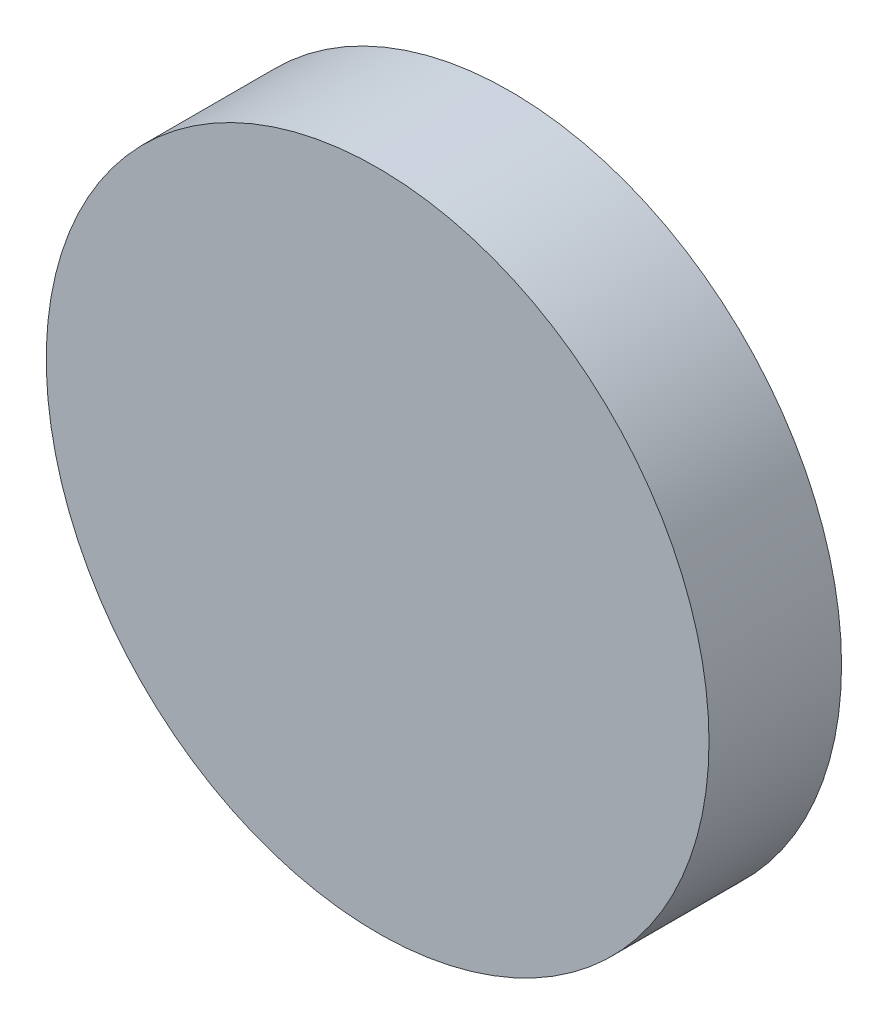
ISO-10303-21;
HEADER;
FILE_DESCRIPTION(('STEP AP214'),'2;1');
FILE_NAME('part.step','',(''),(''),'','','');
FILE_SCHEMA(('AUTOMOTIVE_DESIGN { 1 0 10303 214 1 1 1 1 }'));
ENDSEC;
DATA;
#1=APPLICATION_CONTEXT('core data for automotive mechanical design processes');
#2=APPLICATION_PROTOCOL_DEFINITION('international standard','automotive_design',2000,#1);
#3=PRODUCT_CONTEXT('',#1,'mechanical');
#4=PRODUCT('Part','Part','',(#3));
#5=PRODUCT_RELATED_PRODUCT_CATEGORY('part','',(#4));
#6=PRODUCT_DEFINITION_FORMATION('','',#4);
#7=PRODUCT_DEFINITION_CONTEXT('part definition',#1,'design');
#8=PRODUCT_DEFINITION('design','',#6,#7);
#9=PRODUCT_DEFINITION_SHAPE('','',#8);
#10=(LENGTH_UNIT() NAMED_UNIT(*) SI_UNIT(.MILLI.,.METRE.));
#11=(NAMED_UNIT(*) PLANE_ANGLE_UNIT() SI_UNIT($,.RADIAN.));
#12=(NAMED_UNIT(*) SI_UNIT($,.STERADIAN.) SOLID_ANGLE_UNIT());
#13=UNCERTAINTY_MEASURE_WITH_UNIT(LENGTH_MEASURE(1.E-05),#10,'distance_accuracy_value','');
#14=(GEOMETRIC_REPRESENTATION_CONTEXT(3) GLOBAL_UNCERTAINTY_ASSIGNED_CONTEXT((#13)) GLOBAL_UNIT_ASSIGNED_CONTEXT((#10,
#11,#12)) REPRESENTATION_CONTEXT('',''));
#15=CARTESIAN_POINT('',(0.,0.,0.));
#16=DIRECTION('',(0.,0.,1.));
#17=DIRECTION('',(1.,0.,0.));
#18=AXIS2_PLACEMENT_3D('',#15,#16,#17);
#19=CARTESIAN_POINT('',(0.,0.,12.));
#20=DIRECTION('',(0.,0.,-1.));
#21=DIRECTION('',(-1.,0.,0.));
#22=AXIS2_PLACEMENT_3D('',#19,#20,#21);
#23=CYLINDRICAL_SURFACE('',#22,30.);
#24=CARTESIAN_POINT('',(0.,0.,12.));
#25=DIRECTION('',(0.,0.,1.));
#26=DIRECTION('',(1.,0.,0.));
#27=AXIS2_PLACEMENT_3D('',#24,#25,#26);
#28=CIRCLE('',#27,30.);
#29=CARTESIAN_POINT('',(30.,0.,12.));
#30=VERTEX_POINT('',#29);
#31=EDGE_CURVE('E10',#30,#30,#28,.T.);
#32=ORIENTED_EDGE('',*,*,#31,.F.);
#33=EDGE_LOOP('',(#32));
#34=FACE_BOUND('',#33,.T.);
#35=CARTESIAN_POINT('',(0.,0.,0.));
#36=DIRECTION('',(0.,0.,1.));
#37=DIRECTION('',(1.,0.,0.));
#38=AXIS2_PLACEMENT_3D('',#35,#36,#37);
#39=CIRCLE('',#38,30.);
#40=CARTESIAN_POINT('',(30.,0.,0.));
#41=VERTEX_POINT('',#40);
#42=EDGE_CURVE('E46',#41,#41,#39,.T.);
#43=ORIENTED_EDGE('',*,*,#42,.T.);
#44=EDGE_LOOP('',(#43));
#45=FACE_BOUND('',#44,.T.);
#46=ADVANCED_FACE('F43',(#34,#45),#23,.T.);
#47=CARTESIAN_POINT('',(0.,0.,12.));
#48=DIRECTION('',(0.,0.,1.));
#49=DIRECTION('',(1.,0.,0.));
#50=AXIS2_PLACEMENT_3D('',#47,#48,#49);
#51=PLANE('',#50);
#52=ORIENTED_EDGE('',*,*,#31,.T.);
#53=EDGE_LOOP('',(#52));
#54=FACE_BOUND('',#53,.T.);
#55=ADVANCED_FACE('F60',(#54),#51,.T.);
#56=CARTESIAN_POINT('',(0.,0.,0.));
#57=DIRECTION('',(0.,0.,1.));
#58=DIRECTION('',(1.,0.,0.));
#59=AXIS2_PLACEMENT_3D('',#56,#57,#58);
#60=PLANE('',#59);
#61=ORIENTED_EDGE('',*,*,#42,.F.);
#62=EDGE_LOOP('',(#61));
#63=FACE_BOUND('',#62,.T.);
#64=ADVANCED_FACE('F58',(#63),#60,.F.);
#65=CLOSED_SHELL('',(#46,#55,#64));
#66=MANIFOLD_SOLID_BREP('B2',#65);
#67=ADVANCED_BREP_SHAPE_REPRESENTATION('',(#18,#66),#14);
#68=SHAPE_DEFINITION_REPRESENTATION(#9,#67);
ENDSEC;
END-ISO-10303-21;
